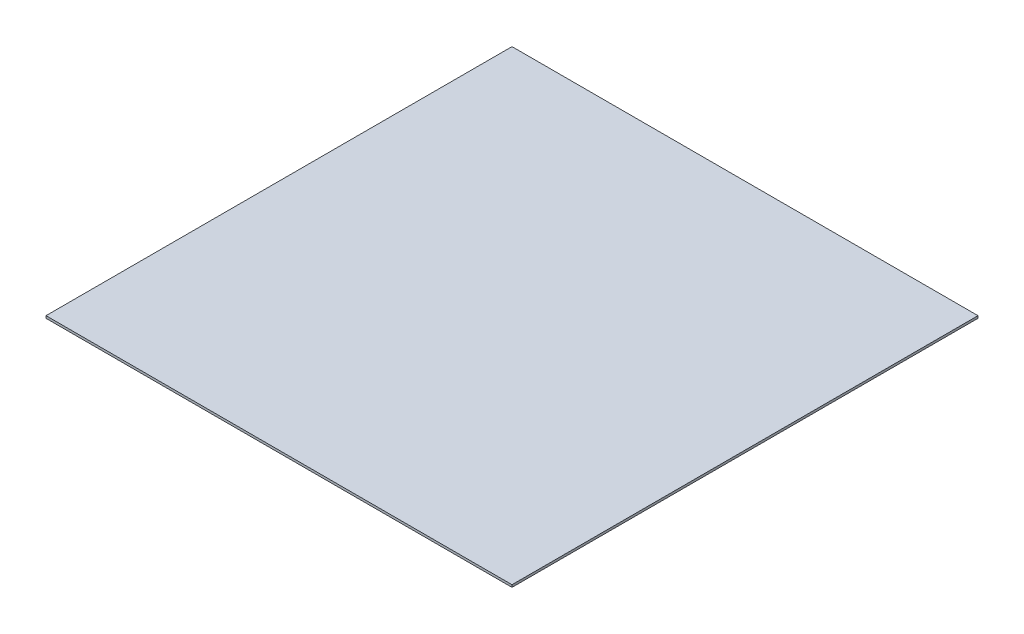
ISO-10303-21;
HEADER;
FILE_DESCRIPTION(('STEP AP214'),'2;1');
FILE_NAME('part.step','',(''),(''),'','','');
FILE_SCHEMA(('AUTOMOTIVE_DESIGN { 1 0 10303 214 1 1 1 1 }'));
ENDSEC;
DATA;
#1=APPLICATION_CONTEXT('core data for automotive mechanical design processes');
#2=APPLICATION_PROTOCOL_DEFINITION('international standard','automotive_design',2000,#1);
#3=PRODUCT_CONTEXT('',#1,'mechanical');
#4=PRODUCT('Part','Part','',(#3));
#5=PRODUCT_RELATED_PRODUCT_CATEGORY('part','',(#4));
#6=PRODUCT_DEFINITION_FORMATION('','',#4);
#7=PRODUCT_DEFINITION_CONTEXT('part definition',#1,'design');
#8=PRODUCT_DEFINITION('design','',#6,#7);
#9=PRODUCT_DEFINITION_SHAPE('','',#8);
#10=(LENGTH_UNIT() NAMED_UNIT(*) SI_UNIT(.MILLI.,.METRE.));
#11=(NAMED_UNIT(*) PLANE_ANGLE_UNIT() SI_UNIT($,.RADIAN.));
#12=(NAMED_UNIT(*) SI_UNIT($,.STERADIAN.) SOLID_ANGLE_UNIT());
#13=UNCERTAINTY_MEASURE_WITH_UNIT(LENGTH_MEASURE(1.E-05),#10,'distance_accuracy_value','');
#14=(GEOMETRIC_REPRESENTATION_CONTEXT(3) GLOBAL_UNCERTAINTY_ASSIGNED_CONTEXT((#13)) GLOBAL_UNIT_ASSIGNED_CONTEXT((#10,
#11,#12)) REPRESENTATION_CONTEXT('',''));
#15=CARTESIAN_POINT('',(0.,0.,0.));
#16=DIRECTION('',(0.,0.,1.));
#17=DIRECTION('',(1.,0.,0.));
#18=AXIS2_PLACEMENT_3D('',#15,#16,#17);
#19=CARTESIAN_POINT('',(-100.,1.,-100.));
#20=DIRECTION('',(1.,0.,0.));
#21=DIRECTION('',(0.,0.,-1.));
#22=AXIS2_PLACEMENT_3D('',#19,#20,#21);
#23=PLANE('',#22);
#24=DIRECTION('',(0.,0.,1.));
#25=VECTOR('',#24,1.);
#26=CARTESIAN_POINT('',(-100.,0.,-100.));
#27=LINE('',#26,#25);
#28=CARTESIAN_POINT('',(-100.,0.,-100.));
#29=VERTEX_POINT('',#28);
#30=CARTESIAN_POINT('',(-100.,0.,100.));
#31=VERTEX_POINT('',#30);
#32=EDGE_CURVE('E97',#29,#31,#27,.T.);
#33=ORIENTED_EDGE('',*,*,#32,.T.);
#34=DIRECTION('',(0.,-1.,0.));
#35=VECTOR('',#34,1.);
#36=CARTESIAN_POINT('',(-100.,1.,100.));
#37=LINE('',#36,#35);
#38=CARTESIAN_POINT('',(-100.,1.,100.));
#39=VERTEX_POINT('',#38);
#40=EDGE_CURVE('E11',#39,#31,#37,.T.);
#41=ORIENTED_EDGE('',*,*,#40,.F.);
#42=DIRECTION('',(0.,0.,1.));
#43=VECTOR('',#42,1.);
#44=CARTESIAN_POINT('',(-100.,1.,-100.));
#45=LINE('',#44,#43);
#46=CARTESIAN_POINT('',(-100.,1.,-100.));
#47=VERTEX_POINT('',#46);
#48=EDGE_CURVE('E85',#47,#39,#45,.T.);
#49=ORIENTED_EDGE('',*,*,#48,.F.);
#50=DIRECTION('',(0.,-1.,0.));
#51=VECTOR('',#50,1.);
#52=CARTESIAN_POINT('',(-100.,1.,-100.));
#53=LINE('',#52,#51);
#54=EDGE_CURVE('E93',#47,#29,#53,.T.);
#55=ORIENTED_EDGE('',*,*,#54,.T.);
#56=EDGE_LOOP('',(#33,#41,#49,#55));
#57=FACE_BOUND('',#56,.T.);
#58=ADVANCED_FACE('F34',(#57),#23,.F.);
#59=CARTESIAN_POINT('',(-100.,1.,100.));
#60=DIRECTION('',(0.,0.,-1.));
#61=DIRECTION('',(-1.,0.,0.));
#62=AXIS2_PLACEMENT_3D('',#59,#60,#61);
#63=PLANE('',#62);
#64=DIRECTION('',(1.,0.,0.));
#65=VECTOR('',#64,1.);
#66=CARTESIAN_POINT('',(-100.,0.,100.));
#67=LINE('',#66,#65);
#68=CARTESIAN_POINT('',(100.,0.,100.));
#69=VERTEX_POINT('',#68);
#70=EDGE_CURVE('E89',#31,#69,#67,.T.);
#71=ORIENTED_EDGE('',*,*,#70,.T.);
#72=DIRECTION('',(0.,-1.,0.));
#73=VECTOR('',#72,1.);
#74=CARTESIAN_POINT('',(100.,1.,100.));
#75=LINE('',#74,#73);
#76=CARTESIAN_POINT('',(100.,1.,100.));
#77=VERTEX_POINT('',#76);
#78=EDGE_CURVE('E42',#77,#69,#75,.T.);
#79=ORIENTED_EDGE('',*,*,#78,.F.);
#80=DIRECTION('',(1.,0.,0.));
#81=VECTOR('',#80,1.);
#82=CARTESIAN_POINT('',(-100.,1.,100.));
#83=LINE('',#82,#81);
#84=EDGE_CURVE('E80',#39,#77,#83,.T.);
#85=ORIENTED_EDGE('',*,*,#84,.F.);
#86=ORIENTED_EDGE('',*,*,#40,.T.);
#87=EDGE_LOOP('',(#71,#79,#85,#86));
#88=FACE_BOUND('',#87,.T.);
#89=ADVANCED_FACE('F88',(#88),#63,.F.);
#90=CARTESIAN_POINT('',(100.,1.,-100.));
#91=DIRECTION('',(-1.,0.,0.));
#92=DIRECTION('',(0.,0.,1.));
#93=AXIS2_PLACEMENT_3D('',#90,#91,#92);
#94=PLANE('',#93);
#95=DIRECTION('',(0.,0.,-1.));
#96=VECTOR('',#95,1.);
#97=CARTESIAN_POINT('',(100.,0.,-100.));
#98=LINE('',#97,#96);
#99=CARTESIAN_POINT('',(100.,0.,-100.));
#100=VERTEX_POINT('',#99);
#101=EDGE_CURVE('E67',#69,#100,#98,.T.);
#102=ORIENTED_EDGE('',*,*,#101,.T.);
#103=DIRECTION('',(0.,-1.,0.));
#104=VECTOR('',#103,1.);
#105=CARTESIAN_POINT('',(100.,1.,-100.));
#106=LINE('',#105,#104);
#107=CARTESIAN_POINT('',(100.,1.,-100.));
#108=VERTEX_POINT('',#107);
#109=EDGE_CURVE('E90',#108,#100,#106,.T.);
#110=ORIENTED_EDGE('',*,*,#109,.F.);
#111=DIRECTION('',(0.,0.,-1.));
#112=VECTOR('',#111,1.);
#113=CARTESIAN_POINT('',(100.,1.,-100.));
#114=LINE('',#113,#112);
#115=EDGE_CURVE('E83',#77,#108,#114,.T.);
#116=ORIENTED_EDGE('',*,*,#115,.F.);
#117=ORIENTED_EDGE('',*,*,#78,.T.);
#118=EDGE_LOOP('',(#102,#110,#116,#117));
#119=FACE_BOUND('',#118,.T.);
#120=ADVANCED_FACE('F91',(#119),#94,.F.);
#121=CARTESIAN_POINT('',(-100.,1.,-100.));
#122=DIRECTION('',(0.,0.,1.));
#123=DIRECTION('',(1.,0.,0.));
#124=AXIS2_PLACEMENT_3D('',#121,#122,#123);
#125=PLANE('',#124);
#126=DIRECTION('',(-1.,0.,0.));
#127=VECTOR('',#126,1.);
#128=CARTESIAN_POINT('',(-100.,0.,-100.));
#129=LINE('',#128,#127);
#130=EDGE_CURVE('E73',#100,#29,#129,.T.);
#131=ORIENTED_EDGE('',*,*,#130,.T.);
#132=ORIENTED_EDGE('',*,*,#54,.F.);
#133=DIRECTION('',(-1.,0.,0.));
#134=VECTOR('',#133,1.);
#135=CARTESIAN_POINT('',(-100.,1.,-100.));
#136=LINE('',#135,#134);
#137=EDGE_CURVE('E50',#108,#47,#136,.T.);
#138=ORIENTED_EDGE('',*,*,#137,.F.);
#139=ORIENTED_EDGE('',*,*,#109,.T.);
#140=EDGE_LOOP('',(#131,#132,#138,#139));
#141=FACE_BOUND('',#140,.T.);
#142=ADVANCED_FACE('F104',(#141),#125,.F.);
#143=CARTESIAN_POINT('',(0.,1.,0.));
#144=DIRECTION('',(0.,1.,0.));
#145=DIRECTION('',(0.,0.,1.));
#146=AXIS2_PLACEMENT_3D('',#143,#144,#145);
#147=PLANE('',#146);
#148=ORIENTED_EDGE('',*,*,#48,.T.);
#149=ORIENTED_EDGE('',*,*,#84,.T.);
#150=ORIENTED_EDGE('',*,*,#115,.T.);
#151=ORIENTED_EDGE('',*,*,#137,.T.);
#152=EDGE_LOOP('',(#148,#149,#150,#151));
#153=FACE_BOUND('',#152,.T.);
#154=ADVANCED_FACE('F81',(#153),#147,.T.);
#155=CARTESIAN_POINT('',(0.,0.,0.));
#156=DIRECTION('',(0.,1.,0.));
#157=DIRECTION('',(0.,0.,1.));
#158=AXIS2_PLACEMENT_3D('',#155,#156,#157);
#159=PLANE('',#158);
#160=ORIENTED_EDGE('',*,*,#32,.F.);
#161=ORIENTED_EDGE('',*,*,#130,.F.);
#162=ORIENTED_EDGE('',*,*,#101,.F.);
#163=ORIENTED_EDGE('',*,*,#70,.F.);
#164=EDGE_LOOP('',(#160,#161,#162,#163));
#165=FACE_BOUND('',#164,.T.);
#166=ADVANCED_FACE('F107',(#165),#159,.F.);
#167=CLOSED_SHELL('',(#58,#89,#120,#142,#154,#166));
#168=MANIFOLD_SOLID_BREP('B2',#167);
#169=ADVANCED_BREP_SHAPE_REPRESENTATION('',(#18,#168),#14);
#170=SHAPE_DEFINITION_REPRESENTATION(#9,#169);
ENDSEC;
END-ISO-10303-21;
